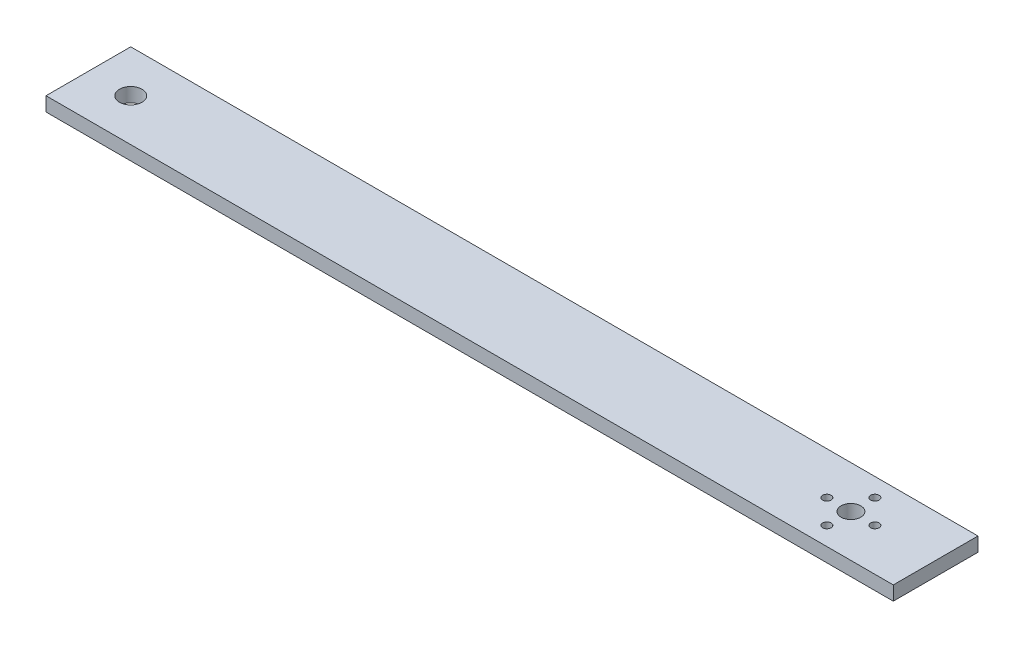
ISO-10303-21;
HEADER;
FILE_DESCRIPTION(('STEP AP214'),'2;1');
FILE_NAME('part.step','',(''),(''),'','','');
FILE_SCHEMA(('AUTOMOTIVE_DESIGN { 1 0 10303 214 1 1 1 1 }'));
ENDSEC;
DATA;
#1=APPLICATION_CONTEXT('core data for automotive mechanical design processes');
#2=APPLICATION_PROTOCOL_DEFINITION('international standard','automotive_design',2000,#1);
#3=PRODUCT_CONTEXT('',#1,'mechanical');
#4=PRODUCT('Part','Part','',(#3));
#5=PRODUCT_RELATED_PRODUCT_CATEGORY('part','',(#4));
#6=PRODUCT_DEFINITION_FORMATION('','',#4);
#7=PRODUCT_DEFINITION_CONTEXT('part definition',#1,'design');
#8=PRODUCT_DEFINITION('design','',#6,#7);
#9=PRODUCT_DEFINITION_SHAPE('','',#8);
#10=(LENGTH_UNIT() NAMED_UNIT(*) SI_UNIT(.MILLI.,.METRE.));
#11=(NAMED_UNIT(*) PLANE_ANGLE_UNIT() SI_UNIT($,.RADIAN.));
#12=(NAMED_UNIT(*) SI_UNIT($,.STERADIAN.) SOLID_ANGLE_UNIT());
#13=UNCERTAINTY_MEASURE_WITH_UNIT(LENGTH_MEASURE(1.E-05),#10,'distance_accuracy_value','');
#14=(GEOMETRIC_REPRESENTATION_CONTEXT(3) GLOBAL_UNCERTAINTY_ASSIGNED_CONTEXT((#13)) GLOBAL_UNIT_ASSIGNED_CONTEXT((#10,
#11,#12)) REPRESENTATION_CONTEXT('',''));
#15=CARTESIAN_POINT('',(0.,0.,0.));
#16=DIRECTION('',(0.,0.,1.));
#17=DIRECTION('',(1.,0.,0.));
#18=AXIS2_PLACEMENT_3D('',#15,#16,#17);
#19=CARTESIAN_POINT('',(0.,5.,-30.));
#20=DIRECTION('',(0.,-1.,0.));
#21=DIRECTION('',(0.,0.,-1.));
#22=AXIS2_PLACEMENT_3D('',#19,#20,#21);
#23=PLANE('',#22);
#24=CARTESIAN_POINT('',(270.,5.,-23.5));
#25=DIRECTION('',(0.,1.,0.));
#26=DIRECTION('',(0.,0.,1.));
#27=AXIS2_PLACEMENT_3D('',#24,#25,#26);
#28=CIRCLE('',#27,1.50000000000002);
#29=CARTESIAN_POINT('',(270.,5.,-22.));
#30=VERTEX_POINT('',#29);
#31=EDGE_CURVE('E131',#30,#30,#28,.T.);
#32=ORIENTED_EDGE('',*,*,#31,.F.);
#33=EDGE_LOOP('',(#32));
#34=FACE_BOUND('',#33,.T.);
#35=CARTESIAN_POINT('',(278.5,5.,-15.));
#36=DIRECTION('',(0.,1.,0.));
#37=DIRECTION('',(0.,0.,1.));
#38=AXIS2_PLACEMENT_3D('',#35,#36,#37);
#39=CIRCLE('',#38,1.50000000000002);
#40=CARTESIAN_POINT('',(278.5,5.,-13.5));
#41=VERTEX_POINT('',#40);
#42=EDGE_CURVE('E119',#41,#41,#39,.T.);
#43=ORIENTED_EDGE('',*,*,#42,.F.);
#44=EDGE_LOOP('',(#43));
#45=FACE_BOUND('',#44,.T.);
#46=CARTESIAN_POINT('',(15.,5.,-15.));
#47=DIRECTION('',(0.,1.,0.));
#48=DIRECTION('',(0.,0.,1.));
#49=AXIS2_PLACEMENT_3D('',#46,#47,#48);
#50=CIRCLE('',#49,4.);
#51=CARTESIAN_POINT('',(15.,5.,-11.));
#52=VERTEX_POINT('',#51);
#53=EDGE_CURVE('E98',#52,#52,#50,.T.);
#54=ORIENTED_EDGE('',*,*,#53,.F.);
#55=EDGE_LOOP('',(#54));
#56=FACE_BOUND('',#55,.T.);
#57=DIRECTION('',(0.,0.,1.));
#58=VECTOR('',#57,1.);
#59=CARTESIAN_POINT('',(0.,5.,0.));
#60=LINE('',#59,#58);
#61=CARTESIAN_POINT('',(0.,5.,-30.));
#62=VERTEX_POINT('',#61);
#63=CARTESIAN_POINT('',(0.,5.,0.));
#64=VERTEX_POINT('',#63);
#65=EDGE_CURVE('E83',#62,#64,#60,.T.);
#66=ORIENTED_EDGE('',*,*,#65,.T.);
#67=DIRECTION('',(1.,0.,0.));
#68=VECTOR('',#67,1.);
#69=CARTESIAN_POINT('',(0.,5.,0.));
#70=LINE('',#69,#68);
#71=CARTESIAN_POINT('',(300.,5.,0.));
#72=VERTEX_POINT('',#71);
#73=EDGE_CURVE('E78',#64,#72,#70,.T.);
#74=ORIENTED_EDGE('',*,*,#73,.T.);
#75=DIRECTION('',(0.,0.,-1.));
#76=VECTOR('',#75,1.);
#77=CARTESIAN_POINT('',(300.,5.,0.));
#78=LINE('',#77,#76);
#79=CARTESIAN_POINT('',(300.,5.,-30.));
#80=VERTEX_POINT('',#79);
#81=EDGE_CURVE('E81',#72,#80,#78,.T.);
#82=ORIENTED_EDGE('',*,*,#81,.T.);
#83=DIRECTION('',(-1.,0.,0.));
#84=VECTOR('',#83,1.);
#85=CARTESIAN_POINT('',(0.,5.,-30.));
#86=LINE('',#85,#84);
#87=EDGE_CURVE('E48',#80,#62,#86,.T.);
#88=ORIENTED_EDGE('',*,*,#87,.T.);
#89=EDGE_LOOP('',(#66,#74,#82,#88));
#90=FACE_BOUND('',#89,.T.);
#91=CARTESIAN_POINT('',(270.,5.,-15.));
#92=DIRECTION('',(0.,1.,0.));
#93=DIRECTION('',(0.,0.,1.));
#94=AXIS2_PLACEMENT_3D('',#91,#92,#93);
#95=CIRCLE('',#94,3.50000000000002);
#96=CARTESIAN_POINT('',(270.,5.,-11.5));
#97=VERTEX_POINT('',#96);
#98=EDGE_CURVE('E113',#97,#97,#95,.T.);
#99=ORIENTED_EDGE('',*,*,#98,.F.);
#100=EDGE_LOOP('',(#99));
#101=FACE_BOUND('',#100,.T.);
#102=CARTESIAN_POINT('',(261.5,5.,-15.));
#103=DIRECTION('',(0.,1.,0.));
#104=DIRECTION('',(0.,0.,1.));
#105=AXIS2_PLACEMENT_3D('',#102,#103,#104);
#106=CIRCLE('',#105,1.50000000000002);
#107=CARTESIAN_POINT('',(261.5,5.,-13.5));
#108=VERTEX_POINT('',#107);
#109=EDGE_CURVE('E125',#108,#108,#106,.T.);
#110=ORIENTED_EDGE('',*,*,#109,.F.);
#111=EDGE_LOOP('',(#110));
#112=FACE_BOUND('',#111,.T.);
#113=CARTESIAN_POINT('',(270.,5.,-6.49999999999998));
#114=DIRECTION('',(0.,1.,0.));
#115=DIRECTION('',(0.,0.,1.));
#116=AXIS2_PLACEMENT_3D('',#113,#114,#115);
#117=CIRCLE('',#116,1.50000000000002);
#118=CARTESIAN_POINT('',(270.,5.,-4.99999999999996));
#119=VERTEX_POINT('',#118);
#120=EDGE_CURVE('E137',#119,#119,#117,.T.);
#121=ORIENTED_EDGE('',*,*,#120,.F.);
#122=EDGE_LOOP('',(#121));
#123=FACE_BOUND('',#122,.T.);
#124=ADVANCED_FACE('F31',(#34,#45,#56,#90,#101,#112,#123),#23,.F.);
#125=CARTESIAN_POINT('',(0.,0.,-30.));
#126=DIRECTION('',(0.,-1.,0.));
#127=DIRECTION('',(0.,0.,-1.));
#128=AXIS2_PLACEMENT_3D('',#125,#126,#127);
#129=PLANE('',#128);
#130=CARTESIAN_POINT('',(270.,0.,-23.5));
#131=DIRECTION('',(0.,1.,0.));
#132=DIRECTION('',(0.,0.,1.));
#133=AXIS2_PLACEMENT_3D('',#130,#131,#132);
#134=CIRCLE('',#133,1.50000000000002);
#135=CARTESIAN_POINT('',(270.,0.,-22.));
#136=VERTEX_POINT('',#135);
#137=EDGE_CURVE('E134',#136,#136,#134,.T.);
#138=ORIENTED_EDGE('',*,*,#137,.T.);
#139=EDGE_LOOP('',(#138));
#140=FACE_BOUND('',#139,.T.);
#141=CARTESIAN_POINT('',(278.5,0.,-15.));
#142=DIRECTION('',(0.,1.,0.));
#143=DIRECTION('',(0.,0.,1.));
#144=AXIS2_PLACEMENT_3D('',#141,#142,#143);
#145=CIRCLE('',#144,1.50000000000002);
#146=CARTESIAN_POINT('',(278.5,0.,-13.5));
#147=VERTEX_POINT('',#146);
#148=EDGE_CURVE('E122',#147,#147,#145,.T.);
#149=ORIENTED_EDGE('',*,*,#148,.T.);
#150=EDGE_LOOP('',(#149));
#151=FACE_BOUND('',#150,.T.);
#152=CARTESIAN_POINT('',(15.,0.,-15.));
#153=DIRECTION('',(0.,1.,0.));
#154=DIRECTION('',(0.,0.,1.));
#155=AXIS2_PLACEMENT_3D('',#152,#153,#154);
#156=CIRCLE('',#155,4.);
#157=CARTESIAN_POINT('',(15.,0.,-11.));
#158=VERTEX_POINT('',#157);
#159=EDGE_CURVE('E110',#158,#158,#156,.T.);
#160=ORIENTED_EDGE('',*,*,#159,.T.);
#161=EDGE_LOOP('',(#160));
#162=FACE_BOUND('',#161,.T.);
#163=DIRECTION('',(0.,0.,1.));
#164=VECTOR('',#163,1.);
#165=CARTESIAN_POINT('',(0.,0.,0.));
#166=LINE('',#165,#164);
#167=CARTESIAN_POINT('',(0.,0.,-30.));
#168=VERTEX_POINT('',#167);
#169=CARTESIAN_POINT('',(0.,0.,0.));
#170=VERTEX_POINT('',#169);
#171=EDGE_CURVE('E95',#168,#170,#166,.T.);
#172=ORIENTED_EDGE('',*,*,#171,.F.);
#173=DIRECTION('',(-1.,0.,0.));
#174=VECTOR('',#173,1.);
#175=CARTESIAN_POINT('',(0.,0.,-30.));
#176=LINE('',#175,#174);
#177=CARTESIAN_POINT('',(300.,0.,-30.));
#178=VERTEX_POINT('',#177);
#179=EDGE_CURVE('E71',#178,#168,#176,.T.);
#180=ORIENTED_EDGE('',*,*,#179,.F.);
#181=DIRECTION('',(0.,0.,-1.));
#182=VECTOR('',#181,1.);
#183=CARTESIAN_POINT('',(300.,0.,0.));
#184=LINE('',#183,#182);
#185=CARTESIAN_POINT('',(300.,0.,0.));
#186=VERTEX_POINT('',#185);
#187=EDGE_CURVE('E65',#186,#178,#184,.T.);
#188=ORIENTED_EDGE('',*,*,#187,.F.);
#189=DIRECTION('',(1.,0.,0.));
#190=VECTOR('',#189,1.);
#191=CARTESIAN_POINT('',(0.,0.,0.));
#192=LINE('',#191,#190);
#193=EDGE_CURVE('E87',#170,#186,#192,.T.);
#194=ORIENTED_EDGE('',*,*,#193,.F.);
#195=EDGE_LOOP('',(#172,#180,#188,#194));
#196=FACE_BOUND('',#195,.T.);
#197=CARTESIAN_POINT('',(270.,0.,-15.));
#198=DIRECTION('',(0.,1.,0.));
#199=DIRECTION('',(0.,0.,1.));
#200=AXIS2_PLACEMENT_3D('',#197,#198,#199);
#201=CIRCLE('',#200,3.50000000000002);
#202=CARTESIAN_POINT('',(270.,0.,-11.5));
#203=VERTEX_POINT('',#202);
#204=EDGE_CURVE('E116',#203,#203,#201,.T.);
#205=ORIENTED_EDGE('',*,*,#204,.T.);
#206=EDGE_LOOP('',(#205));
#207=FACE_BOUND('',#206,.T.);
#208=CARTESIAN_POINT('',(261.5,0.,-15.));
#209=DIRECTION('',(0.,1.,0.));
#210=DIRECTION('',(0.,0.,1.));
#211=AXIS2_PLACEMENT_3D('',#208,#209,#210);
#212=CIRCLE('',#211,1.50000000000002);
#213=CARTESIAN_POINT('',(261.5,0.,-13.5));
#214=VERTEX_POINT('',#213);
#215=EDGE_CURVE('E128',#214,#214,#212,.T.);
#216=ORIENTED_EDGE('',*,*,#215,.T.);
#217=EDGE_LOOP('',(#216));
#218=FACE_BOUND('',#217,.T.);
#219=CARTESIAN_POINT('',(270.,0.,-6.49999999999998));
#220=DIRECTION('',(0.,1.,0.));
#221=DIRECTION('',(0.,0.,1.));
#222=AXIS2_PLACEMENT_3D('',#219,#220,#221);
#223=CIRCLE('',#222,1.50000000000002);
#224=CARTESIAN_POINT('',(270.,0.,-4.99999999999996));
#225=VERTEX_POINT('',#224);
#226=EDGE_CURVE('E140',#225,#225,#223,.T.);
#227=ORIENTED_EDGE('',*,*,#226,.T.);
#228=EDGE_LOOP('',(#227));
#229=FACE_BOUND('',#228,.T.);
#230=ADVANCED_FACE('F106',(#140,#151,#162,#196,#207,#218,#229),#129,.T.);
#231=CARTESIAN_POINT('',(0.,5.,0.));
#232=DIRECTION('',(1.,0.,0.));
#233=DIRECTION('',(0.,0.,-1.));
#234=AXIS2_PLACEMENT_3D('',#231,#232,#233);
#235=PLANE('',#234);
#236=ORIENTED_EDGE('',*,*,#171,.T.);
#237=DIRECTION('',(0.,-1.,0.));
#238=VECTOR('',#237,1.);
#239=CARTESIAN_POINT('',(0.,5.,0.));
#240=LINE('',#239,#238);
#241=EDGE_CURVE('E11',#64,#170,#240,.T.);
#242=ORIENTED_EDGE('',*,*,#241,.F.);
#243=ORIENTED_EDGE('',*,*,#65,.F.);
#244=DIRECTION('',(0.,-1.,0.));
#245=VECTOR('',#244,1.);
#246=CARTESIAN_POINT('',(0.,5.,-30.));
#247=LINE('',#246,#245);
#248=EDGE_CURVE('E91',#62,#168,#247,.T.);
#249=ORIENTED_EDGE('',*,*,#248,.T.);
#250=EDGE_LOOP('',(#236,#242,#243,#249));
#251=FACE_BOUND('',#250,.T.);
#252=ADVANCED_FACE('F33',(#251),#235,.F.);
#253=CARTESIAN_POINT('',(0.,5.,0.));
#254=DIRECTION('',(0.,0.,-1.));
#255=DIRECTION('',(-1.,0.,0.));
#256=AXIS2_PLACEMENT_3D('',#253,#254,#255);
#257=PLANE('',#256);
#258=ORIENTED_EDGE('',*,*,#193,.T.);
#259=DIRECTION('',(0.,-1.,0.));
#260=VECTOR('',#259,1.);
#261=CARTESIAN_POINT('',(300.,5.,0.));
#262=LINE('',#261,#260);
#263=EDGE_CURVE('E40',#72,#186,#262,.T.);
#264=ORIENTED_EDGE('',*,*,#263,.F.);
#265=ORIENTED_EDGE('',*,*,#73,.F.);
#266=ORIENTED_EDGE('',*,*,#241,.T.);
#267=EDGE_LOOP('',(#258,#264,#265,#266));
#268=FACE_BOUND('',#267,.T.);
#269=ADVANCED_FACE('F86',(#268),#257,.F.);
#270=CARTESIAN_POINT('',(300.,5.,0.));
#271=DIRECTION('',(-1.,0.,0.));
#272=DIRECTION('',(0.,0.,1.));
#273=AXIS2_PLACEMENT_3D('',#270,#271,#272);
#274=PLANE('',#273);
#275=ORIENTED_EDGE('',*,*,#187,.T.);
#276=DIRECTION('',(0.,-1.,0.));
#277=VECTOR('',#276,1.);
#278=CARTESIAN_POINT('',(300.,5.,-30.));
#279=LINE('',#278,#277);
#280=EDGE_CURVE('E88',#80,#178,#279,.T.);
#281=ORIENTED_EDGE('',*,*,#280,.F.);
#282=ORIENTED_EDGE('',*,*,#81,.F.);
#283=ORIENTED_EDGE('',*,*,#263,.T.);
#284=EDGE_LOOP('',(#275,#281,#282,#283));
#285=FACE_BOUND('',#284,.T.);
#286=ADVANCED_FACE('F89',(#285),#274,.F.);
#287=CARTESIAN_POINT('',(0.,5.,-30.));
#288=DIRECTION('',(0.,0.,1.));
#289=DIRECTION('',(1.,0.,0.));
#290=AXIS2_PLACEMENT_3D('',#287,#288,#289);
#291=PLANE('',#290);
#292=ORIENTED_EDGE('',*,*,#179,.T.);
#293=ORIENTED_EDGE('',*,*,#248,.F.);
#294=ORIENTED_EDGE('',*,*,#87,.F.);
#295=ORIENTED_EDGE('',*,*,#280,.T.);
#296=EDGE_LOOP('',(#292,#293,#294,#295));
#297=FACE_BOUND('',#296,.T.);
#298=ADVANCED_FACE('F103',(#297),#291,.F.);
#299=CARTESIAN_POINT('',(15.,5.,-15.));
#300=DIRECTION('',(0.,-1.,0.));
#301=DIRECTION('',(0.,0.,-1.));
#302=AXIS2_PLACEMENT_3D('',#299,#300,#301);
#303=CYLINDRICAL_SURFACE('',#302,4.);
#304=ORIENTED_EDGE('',*,*,#53,.T.);
#305=EDGE_LOOP('',(#304));
#306=FACE_BOUND('',#305,.T.);
#307=ORIENTED_EDGE('',*,*,#159,.F.);
#308=EDGE_LOOP('',(#307));
#309=FACE_BOUND('',#308,.T.);
#310=ADVANCED_FACE('F160',(#306,#309),#303,.F.);
#311=CARTESIAN_POINT('',(270.,5.,-15.));
#312=DIRECTION('',(0.,-1.,0.));
#313=DIRECTION('',(0.,0.,-1.));
#314=AXIS2_PLACEMENT_3D('',#311,#312,#313);
#315=CYLINDRICAL_SURFACE('',#314,3.50000000000002);
#316=ORIENTED_EDGE('',*,*,#98,.T.);
#317=EDGE_LOOP('',(#316));
#318=FACE_BOUND('',#317,.T.);
#319=ORIENTED_EDGE('',*,*,#204,.F.);
#320=EDGE_LOOP('',(#319));
#321=FACE_BOUND('',#320,.T.);
#322=ADVANCED_FACE('F206',(#318,#321),#315,.F.);
#323=CARTESIAN_POINT('',(278.5,5.,-15.));
#324=DIRECTION('',(0.,-1.,0.));
#325=DIRECTION('',(0.,0.,-1.));
#326=AXIS2_PLACEMENT_3D('',#323,#324,#325);
#327=CYLINDRICAL_SURFACE('',#326,1.50000000000002);
#328=ORIENTED_EDGE('',*,*,#42,.T.);
#329=EDGE_LOOP('',(#328));
#330=FACE_BOUND('',#329,.T.);
#331=ORIENTED_EDGE('',*,*,#148,.F.);
#332=EDGE_LOOP('',(#331));
#333=FACE_BOUND('',#332,.T.);
#334=ADVANCED_FACE('F214',(#330,#333),#327,.F.);
#335=CARTESIAN_POINT('',(261.5,5.,-15.));
#336=DIRECTION('',(0.,-1.,0.));
#337=DIRECTION('',(0.,0.,-1.));
#338=AXIS2_PLACEMENT_3D('',#335,#336,#337);
#339=CYLINDRICAL_SURFACE('',#338,1.50000000000002);
#340=ORIENTED_EDGE('',*,*,#109,.T.);
#341=EDGE_LOOP('',(#340));
#342=FACE_BOUND('',#341,.T.);
#343=ORIENTED_EDGE('',*,*,#215,.F.);
#344=EDGE_LOOP('',(#343));
#345=FACE_BOUND('',#344,.T.);
#346=ADVANCED_FACE('F222',(#342,#345),#339,.F.);
#347=CARTESIAN_POINT('',(270.,5.,-23.5));
#348=DIRECTION('',(0.,-1.,0.));
#349=DIRECTION('',(0.,0.,-1.));
#350=AXIS2_PLACEMENT_3D('',#347,#348,#349);
#351=CYLINDRICAL_SURFACE('',#350,1.50000000000002);
#352=ORIENTED_EDGE('',*,*,#31,.T.);
#353=EDGE_LOOP('',(#352));
#354=FACE_BOUND('',#353,.T.);
#355=ORIENTED_EDGE('',*,*,#137,.F.);
#356=EDGE_LOOP('',(#355));
#357=FACE_BOUND('',#356,.T.);
#358=ADVANCED_FACE('F231',(#354,#357),#351,.F.);
#359=CARTESIAN_POINT('',(270.,5.,-6.49999999999998));
#360=DIRECTION('',(0.,-1.,0.));
#361=DIRECTION('',(0.,0.,-1.));
#362=AXIS2_PLACEMENT_3D('',#359,#360,#361);
#363=CYLINDRICAL_SURFACE('',#362,1.50000000000002);
#364=ORIENTED_EDGE('',*,*,#120,.T.);
#365=EDGE_LOOP('',(#364));
#366=FACE_BOUND('',#365,.T.);
#367=ORIENTED_EDGE('',*,*,#226,.F.);
#368=EDGE_LOOP('',(#367));
#369=FACE_BOUND('',#368,.T.);
#370=ADVANCED_FACE('F146',(#366,#369),#363,.F.);
#371=CLOSED_SHELL('',(#124,#230,#252,#269,#286,#298,#310,#322,#334,#346,#358,#370));
#372=MANIFOLD_SOLID_BREP('B2',#371);
#373=ADVANCED_BREP_SHAPE_REPRESENTATION('',(#18,#372),#14);
#374=SHAPE_DEFINITION_REPRESENTATION(#9,#373);
ENDSEC;
END-ISO-10303-21;
